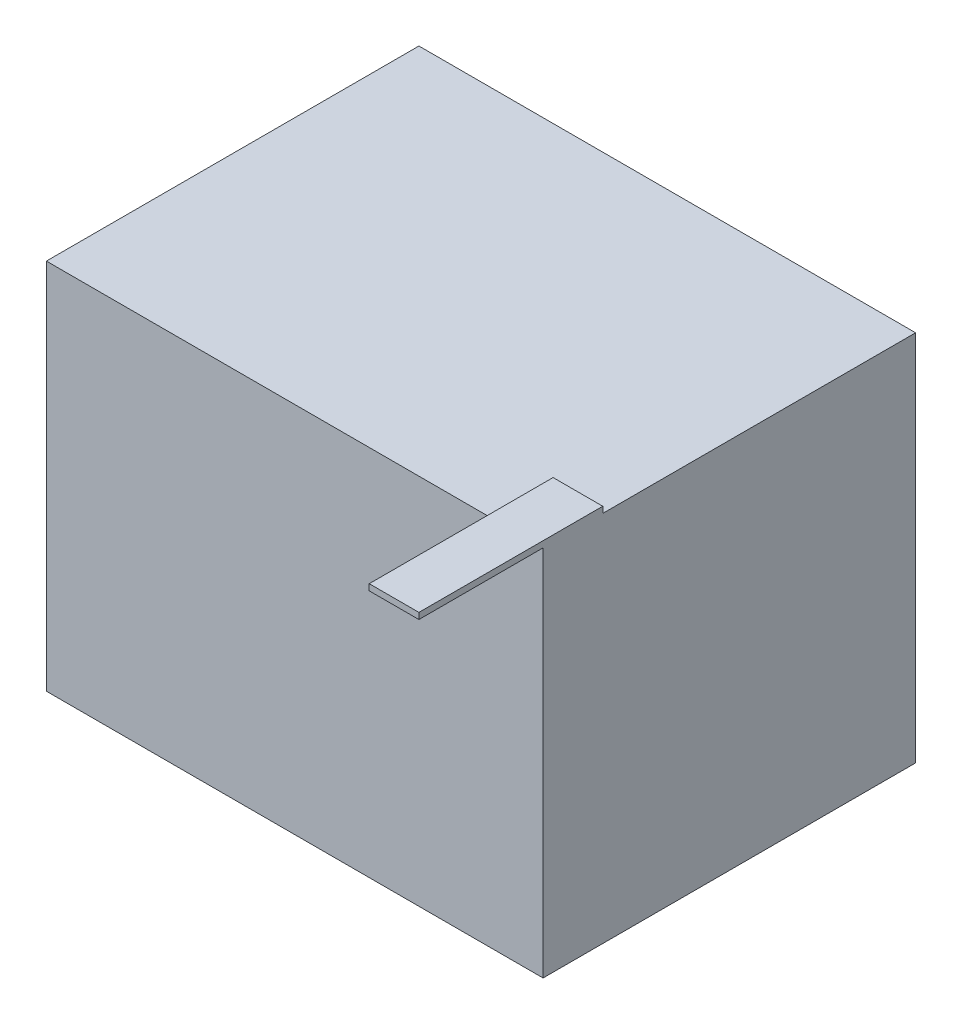
ISO-10303-21;
HEADER;
FILE_DESCRIPTION(('STEP AP214'),'2;1');
FILE_NAME('part.step','',(''),(''),'','','');
FILE_SCHEMA(('AUTOMOTIVE_DESIGN { 1 0 10303 214 1 1 1 1 }'));
ENDSEC;
DATA;
#1=APPLICATION_CONTEXT('core data for automotive mechanical design processes');
#2=APPLICATION_PROTOCOL_DEFINITION('international standard','automotive_design',2000,#1);
#3=PRODUCT_CONTEXT('',#1,'mechanical');
#4=PRODUCT('Part','Part','',(#3));
#5=PRODUCT_RELATED_PRODUCT_CATEGORY('part','',(#4));
#6=PRODUCT_DEFINITION_FORMATION('','',#4);
#7=PRODUCT_DEFINITION_CONTEXT('part definition',#1,'design');
#8=PRODUCT_DEFINITION('design','',#6,#7);
#9=PRODUCT_DEFINITION_SHAPE('','',#8);
#10=(LENGTH_UNIT() NAMED_UNIT(*) SI_UNIT(.MILLI.,.METRE.));
#11=(NAMED_UNIT(*) PLANE_ANGLE_UNIT() SI_UNIT($,.RADIAN.));
#12=(NAMED_UNIT(*) SI_UNIT($,.STERADIAN.) SOLID_ANGLE_UNIT());
#13=UNCERTAINTY_MEASURE_WITH_UNIT(LENGTH_MEASURE(1.E-05),#10,'distance_accuracy_value','');
#14=(GEOMETRIC_REPRESENTATION_CONTEXT(3) GLOBAL_UNCERTAINTY_ASSIGNED_CONTEXT((#13)) GLOBAL_UNIT_ASSIGNED_CONTEXT((#10,
#11,#12)) REPRESENTATION_CONTEXT('',''));
#15=CARTESIAN_POINT('',(0.,0.,0.));
#16=DIRECTION('',(0.,0.,1.));
#17=DIRECTION('',(1.,0.,0.));
#18=AXIS2_PLACEMENT_3D('',#15,#16,#17);
#19=CARTESIAN_POINT('',(0.,600.,0.));
#20=DIRECTION('',(0.,-1.,0.));
#21=DIRECTION('',(0.,0.,-1.));
#22=AXIS2_PLACEMENT_3D('',#19,#20,#21);
#23=PLANE('',#22);
#24=DIRECTION('',(0.,0.,1.));
#25=VECTOR('',#24,1.);
#26=CARTESIAN_POINT('',(720.,600.,-96.0954165224166));
#27=LINE('',#26,#25);
#28=CARTESIAN_POINT('',(720.,600.,-96.0954165224166));
#29=VERTEX_POINT('',#28);
#30=CARTESIAN_POINT('',(720.,600.,0.));
#31=VERTEX_POINT('',#30);
#32=EDGE_CURVE('E128',#29,#31,#27,.T.);
#33=ORIENTED_EDGE('',*,*,#32,.F.);
#34=DIRECTION('',(-1.,0.,0.));
#35=VECTOR('',#34,1.);
#36=CARTESIAN_POINT('',(800.,600.,-96.0954165224166));
#37=LINE('',#36,#35);
#38=CARTESIAN_POINT('',(800.,600.,-96.0954165224166));
#39=VERTEX_POINT('',#38);
#40=EDGE_CURVE('E48',#39,#29,#37,.T.);
#41=ORIENTED_EDGE('',*,*,#40,.F.);
#42=DIRECTION('',(0.,0.,-1.));
#43=VECTOR('',#42,1.);
#44=CARTESIAN_POINT('',(800.,600.,0.));
#45=LINE('',#44,#43);
#46=CARTESIAN_POINT('',(800.,600.,-600.));
#47=VERTEX_POINT('',#46);
#48=EDGE_CURVE('E151',#39,#47,#45,.T.);
#49=ORIENTED_EDGE('',*,*,#48,.T.);
#50=DIRECTION('',(-1.,0.,0.));
#51=VECTOR('',#50,1.);
#52=CARTESIAN_POINT('',(0.,600.,-600.));
#53=LINE('',#52,#51);
#54=CARTESIAN_POINT('',(0.,600.,-600.));
#55=VERTEX_POINT('',#54);
#56=EDGE_CURVE('E153',#47,#55,#53,.T.);
#57=ORIENTED_EDGE('',*,*,#56,.T.);
#58=DIRECTION('',(0.,0.,1.));
#59=VECTOR('',#58,1.);
#60=CARTESIAN_POINT('',(0.,600.,0.));
#61=LINE('',#60,#59);
#62=CARTESIAN_POINT('',(0.,600.,0.));
#63=VERTEX_POINT('',#62);
#64=EDGE_CURVE('E145',#55,#63,#61,.T.);
#65=ORIENTED_EDGE('',*,*,#64,.T.);
#66=DIRECTION('',(1.,0.,0.));
#67=VECTOR('',#66,1.);
#68=CARTESIAN_POINT('',(0.,600.,0.));
#69=LINE('',#68,#67);
#70=EDGE_CURVE('E149',#63,#31,#69,.T.);
#71=ORIENTED_EDGE('',*,*,#70,.T.);
#72=EDGE_LOOP('',(#33,#41,#49,#57,#65,#71));
#73=FACE_BOUND('',#72,.T.);
#74=ADVANCED_FACE('F33',(#73),#23,.F.);
#75=CARTESIAN_POINT('',(0.,600.,0.));
#76=DIRECTION('',(1.,0.,0.));
#77=DIRECTION('',(0.,0.,-1.));
#78=AXIS2_PLACEMENT_3D('',#75,#76,#77);
#79=PLANE('',#78);
#80=DIRECTION('',(0.,0.,1.));
#81=VECTOR('',#80,1.);
#82=CARTESIAN_POINT('',(0.,0.,0.));
#83=LINE('',#82,#81);
#84=CARTESIAN_POINT('',(0.,0.,-600.));
#85=VERTEX_POINT('',#84);
#86=CARTESIAN_POINT('',(0.,0.,0.));
#87=VERTEX_POINT('',#86);
#88=EDGE_CURVE('E140',#85,#87,#83,.T.);
#89=ORIENTED_EDGE('',*,*,#88,.T.);
#90=DIRECTION('',(0.,-1.,0.));
#91=VECTOR('',#90,1.);
#92=CARTESIAN_POINT('',(0.,600.,0.));
#93=LINE('',#92,#91);
#94=EDGE_CURVE('E11',#63,#87,#93,.T.);
#95=ORIENTED_EDGE('',*,*,#94,.F.);
#96=ORIENTED_EDGE('',*,*,#64,.F.);
#97=DIRECTION('',(0.,-1.,0.));
#98=VECTOR('',#97,1.);
#99=CARTESIAN_POINT('',(0.,600.,-600.));
#100=LINE('',#99,#98);
#101=EDGE_CURVE('E155',#55,#85,#100,.T.);
#102=ORIENTED_EDGE('',*,*,#101,.T.);
#103=EDGE_LOOP('',(#89,#95,#96,#102));
#104=FACE_BOUND('',#103,.T.);
#105=ADVANCED_FACE('F35',(#104),#79,.F.);
#106=CARTESIAN_POINT('',(0.,600.,0.));
#107=DIRECTION('',(0.,0.,-1.));
#108=DIRECTION('',(-1.,0.,0.));
#109=AXIS2_PLACEMENT_3D('',#106,#107,#108);
#110=PLANE('',#109);
#111=DIRECTION('',(1.,0.,0.));
#112=VECTOR('',#111,1.);
#113=CARTESIAN_POINT('',(0.,0.,0.));
#114=LINE('',#113,#112);
#115=CARTESIAN_POINT('',(800.,0.,0.));
#116=VERTEX_POINT('',#115);
#117=EDGE_CURVE('E158',#87,#116,#114,.T.);
#118=ORIENTED_EDGE('',*,*,#117,.T.);
#119=DIRECTION('',(0.,-1.,0.));
#120=VECTOR('',#119,1.);
#121=CARTESIAN_POINT('',(800.,600.,0.));
#122=LINE('',#121,#120);
#123=CARTESIAN_POINT('',(800.,600.,0.));
#124=VERTEX_POINT('',#123);
#125=EDGE_CURVE('E41',#124,#116,#122,.T.);
#126=ORIENTED_EDGE('',*,*,#125,.F.);
#127=EDGE_CURVE('E56',#31,#124,#69,.T.);
#128=ORIENTED_EDGE('',*,*,#127,.F.);
#129=ORIENTED_EDGE('',*,*,#70,.F.);
#130=ORIENTED_EDGE('',*,*,#94,.T.);
#131=EDGE_LOOP('',(#118,#126,#128,#129,#130));
#132=FACE_BOUND('',#131,.T.);
#133=ADVANCED_FACE('F201',(#132),#110,.F.);
#134=CARTESIAN_POINT('',(800.,600.,0.));
#135=DIRECTION('',(-1.,0.,0.));
#136=DIRECTION('',(0.,0.,1.));
#137=AXIS2_PLACEMENT_3D('',#134,#135,#136);
#138=PLANE('',#137);
#139=DIRECTION('',(0.,0.,-1.));
#140=VECTOR('',#139,1.);
#141=CARTESIAN_POINT('',(800.,0.,0.));
#142=LINE('',#141,#140);
#143=CARTESIAN_POINT('',(800.,0.,-600.));
#144=VERTEX_POINT('',#143);
#145=EDGE_CURVE('E160',#116,#144,#142,.T.);
#146=ORIENTED_EDGE('',*,*,#145,.T.);
#147=DIRECTION('',(0.,-1.,0.));
#148=VECTOR('',#147,1.);
#149=CARTESIAN_POINT('',(800.,600.,-600.));
#150=LINE('',#149,#148);
#151=EDGE_CURVE('E165',#47,#144,#150,.T.);
#152=ORIENTED_EDGE('',*,*,#151,.F.);
#153=ORIENTED_EDGE('',*,*,#48,.F.);
#154=DIRECTION('',(0.,-1.,0.));
#155=VECTOR('',#154,1.);
#156=CARTESIAN_POINT('',(800.,610.,-96.0954165224166));
#157=LINE('',#156,#155);
#158=CARTESIAN_POINT('',(800.,610.,-96.0954165224166));
#159=VERTEX_POINT('',#158);
#160=EDGE_CURVE('E125',#159,#39,#157,.T.);
#161=ORIENTED_EDGE('',*,*,#160,.F.);
#162=DIRECTION('',(0.,0.,1.));
#163=VECTOR('',#162,1.);
#164=CARTESIAN_POINT('',(800.,610.,-96.0954165224166));
#165=LINE('',#164,#163);
#166=CARTESIAN_POINT('',(800.,610.,200.));
#167=VERTEX_POINT('',#166);
#168=EDGE_CURVE('E118',#159,#167,#165,.T.);
#169=ORIENTED_EDGE('',*,*,#168,.T.);
#170=DIRECTION('',(0.,-1.,0.));
#171=VECTOR('',#170,1.);
#172=CARTESIAN_POINT('',(800.,610.,200.));
#173=LINE('',#172,#171);
#174=CARTESIAN_POINT('',(800.,600.,200.));
#175=VERTEX_POINT('',#174);
#176=EDGE_CURVE('E102',#167,#175,#173,.T.);
#177=ORIENTED_EDGE('',*,*,#176,.T.);
#178=DIRECTION('',(0.,0.,1.));
#179=VECTOR('',#178,1.);
#180=CARTESIAN_POINT('',(800.,600.,-96.0954165224166));
#181=LINE('',#180,#179);
#182=EDGE_CURVE('E133',#124,#175,#181,.T.);
#183=ORIENTED_EDGE('',*,*,#182,.F.);
#184=ORIENTED_EDGE('',*,*,#125,.T.);
#185=EDGE_LOOP('',(#146,#152,#153,#161,#169,#177,#183,#184));
#186=FACE_BOUND('',#185,.T.);
#187=ADVANCED_FACE('F123',(#186),#138,.F.);
#188=CARTESIAN_POINT('',(0.,600.,-600.));
#189=DIRECTION('',(0.,0.,1.));
#190=DIRECTION('',(1.,0.,0.));
#191=AXIS2_PLACEMENT_3D('',#188,#189,#190);
#192=PLANE('',#191);
#193=DIRECTION('',(-1.,0.,0.));
#194=VECTOR('',#193,1.);
#195=CARTESIAN_POINT('',(0.,0.,-600.));
#196=LINE('',#195,#194);
#197=EDGE_CURVE('E148',#144,#85,#196,.T.);
#198=ORIENTED_EDGE('',*,*,#197,.T.);
#199=ORIENTED_EDGE('',*,*,#101,.F.);
#200=ORIENTED_EDGE('',*,*,#56,.F.);
#201=ORIENTED_EDGE('',*,*,#151,.T.);
#202=EDGE_LOOP('',(#198,#199,#200,#201));
#203=FACE_BOUND('',#202,.T.);
#204=ADVANCED_FACE('F176',(#203),#192,.F.);
#205=CARTESIAN_POINT('',(0.,0.,0.));
#206=DIRECTION('',(0.,-1.,0.));
#207=DIRECTION('',(0.,0.,-1.));
#208=AXIS2_PLACEMENT_3D('',#205,#206,#207);
#209=PLANE('',#208);
#210=ORIENTED_EDGE('',*,*,#88,.F.);
#211=ORIENTED_EDGE('',*,*,#197,.F.);
#212=ORIENTED_EDGE('',*,*,#145,.F.);
#213=ORIENTED_EDGE('',*,*,#117,.F.);
#214=EDGE_LOOP('',(#210,#211,#212,#213));
#215=FACE_BOUND('',#214,.T.);
#216=ADVANCED_FACE('F173',(#215),#209,.T.);
#217=CARTESIAN_POINT('',(800.,610.,-96.0954165224166));
#218=DIRECTION('',(0.,0.,1.));
#219=DIRECTION('',(1.,0.,0.));
#220=AXIS2_PLACEMENT_3D('',#217,#218,#219);
#221=PLANE('',#220);
#222=ORIENTED_EDGE('',*,*,#40,.T.);
#223=DIRECTION('',(0.,-1.,0.));
#224=VECTOR('',#223,1.);
#225=CARTESIAN_POINT('',(720.,610.,-96.0954165224166));
#226=LINE('',#225,#224);
#227=CARTESIAN_POINT('',(720.,610.,-96.0954165224166));
#228=VERTEX_POINT('',#227);
#229=EDGE_CURVE('E141',#228,#29,#226,.T.);
#230=ORIENTED_EDGE('',*,*,#229,.F.);
#231=DIRECTION('',(-1.,0.,0.));
#232=VECTOR('',#231,1.);
#233=CARTESIAN_POINT('',(800.,610.,-96.0954165224166));
#234=LINE('',#233,#232);
#235=EDGE_CURVE('E113',#159,#228,#234,.T.);
#236=ORIENTED_EDGE('',*,*,#235,.F.);
#237=ORIENTED_EDGE('',*,*,#160,.T.);
#238=EDGE_LOOP('',(#222,#230,#236,#237));
#239=FACE_BOUND('',#238,.T.);
#240=ADVANCED_FACE('F183',(#239),#221,.F.);
#241=CARTESIAN_POINT('',(720.,610.,-96.0954165224166));
#242=DIRECTION('',(1.,0.,0.));
#243=DIRECTION('',(0.,0.,-1.));
#244=AXIS2_PLACEMENT_3D('',#241,#242,#243);
#245=PLANE('',#244);
#246=ORIENTED_EDGE('',*,*,#32,.T.);
#247=CARTESIAN_POINT('',(720.,600.,200.));
#248=VERTEX_POINT('',#247);
#249=EDGE_CURVE('E136',#31,#248,#27,.T.);
#250=ORIENTED_EDGE('',*,*,#249,.T.);
#251=DIRECTION('',(0.,-1.,0.));
#252=VECTOR('',#251,1.);
#253=CARTESIAN_POINT('',(720.,610.,200.));
#254=LINE('',#253,#252);
#255=CARTESIAN_POINT('',(720.,610.,200.));
#256=VERTEX_POINT('',#255);
#257=EDGE_CURVE('E112',#256,#248,#254,.T.);
#258=ORIENTED_EDGE('',*,*,#257,.F.);
#259=DIRECTION('',(0.,0.,1.));
#260=VECTOR('',#259,1.);
#261=CARTESIAN_POINT('',(720.,610.,-96.0954165224166));
#262=LINE('',#261,#260);
#263=EDGE_CURVE('E120',#228,#256,#262,.T.);
#264=ORIENTED_EDGE('',*,*,#263,.F.);
#265=ORIENTED_EDGE('',*,*,#229,.T.);
#266=EDGE_LOOP('',(#246,#250,#258,#264,#265));
#267=FACE_BOUND('',#266,.T.);
#268=ADVANCED_FACE('F186',(#267),#245,.F.);
#269=CARTESIAN_POINT('',(800.,610.,200.));
#270=DIRECTION('',(0.,0.,1.));
#271=DIRECTION('',(1.,0.,0.));
#272=AXIS2_PLACEMENT_3D('',#269,#270,#271);
#273=PLANE('',#272);
#274=DIRECTION('',(-1.,0.,0.));
#275=VECTOR('',#274,1.);
#276=CARTESIAN_POINT('',(800.,600.,200.));
#277=LINE('',#276,#275);
#278=EDGE_CURVE('E108',#175,#248,#277,.T.);
#279=ORIENTED_EDGE('',*,*,#278,.F.);
#280=ORIENTED_EDGE('',*,*,#176,.F.);
#281=DIRECTION('',(-1.,0.,0.));
#282=VECTOR('',#281,1.);
#283=CARTESIAN_POINT('',(800.,610.,200.));
#284=LINE('',#283,#282);
#285=EDGE_CURVE('E106',#167,#256,#284,.T.);
#286=ORIENTED_EDGE('',*,*,#285,.T.);
#287=ORIENTED_EDGE('',*,*,#257,.T.);
#288=EDGE_LOOP('',(#279,#280,#286,#287));
#289=FACE_BOUND('',#288,.T.);
#290=ADVANCED_FACE('F104',(#289),#273,.T.);
#291=CARTESIAN_POINT('',(0.,610.,0.));
#292=DIRECTION('',(0.,-1.,0.));
#293=DIRECTION('',(0.,0.,-1.));
#294=AXIS2_PLACEMENT_3D('',#291,#292,#293);
#295=PLANE('',#294);
#296=ORIENTED_EDGE('',*,*,#168,.F.);
#297=ORIENTED_EDGE('',*,*,#235,.T.);
#298=ORIENTED_EDGE('',*,*,#263,.T.);
#299=ORIENTED_EDGE('',*,*,#285,.F.);
#300=EDGE_LOOP('',(#296,#297,#298,#299));
#301=FACE_BOUND('',#300,.T.);
#302=ADVANCED_FACE('F117',(#301),#295,.F.);
#303=CARTESIAN_POINT('',(0.,600.,0.));
#304=DIRECTION('',(0.,-1.,0.));
#305=DIRECTION('',(0.,0.,-1.));
#306=AXIS2_PLACEMENT_3D('',#303,#304,#305);
#307=PLANE('',#306);
#308=ORIENTED_EDGE('',*,*,#249,.F.);
#309=ORIENTED_EDGE('',*,*,#127,.T.);
#310=ORIENTED_EDGE('',*,*,#182,.T.);
#311=ORIENTED_EDGE('',*,*,#278,.T.);
#312=EDGE_LOOP('',(#308,#309,#310,#311));
#313=FACE_BOUND('',#312,.T.);
#314=ADVANCED_FACE('F188',(#313),#307,.T.);
#315=CLOSED_SHELL('',(#74,#105,#133,#187,#204,#216,#240,#268,#290,#302,#314));
#316=MANIFOLD_SOLID_BREP('B2',#315);
#317=ADVANCED_BREP_SHAPE_REPRESENTATION('',(#18,#316),#14);
#318=SHAPE_DEFINITION_REPRESENTATION(#9,#317);
ENDSEC;
END-ISO-10303-21;
